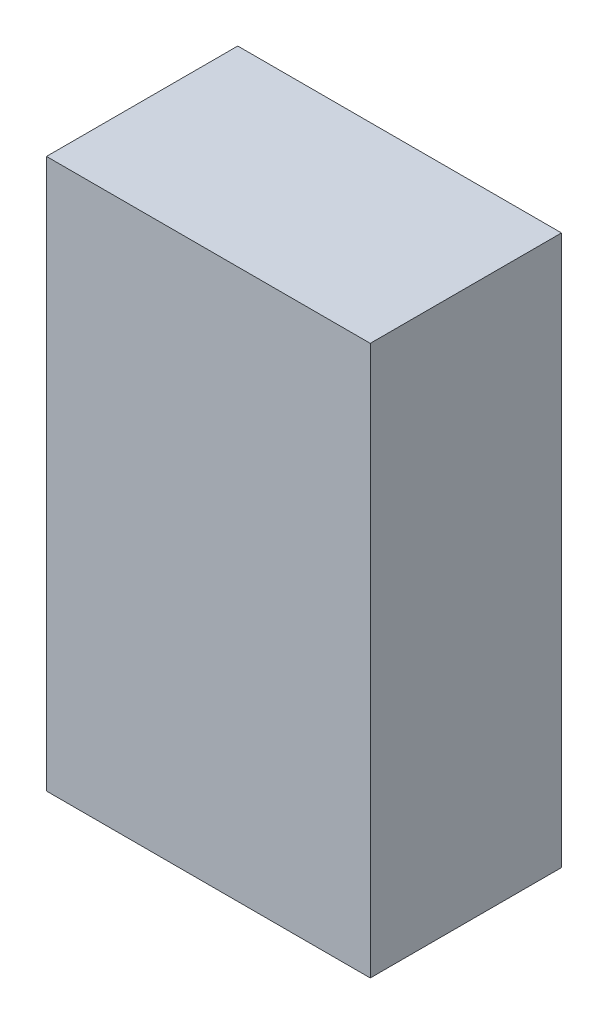
ISO-10303-21;
HEADER;
FILE_DESCRIPTION(('STEP AP214'),'2;1');
FILE_NAME('part.step','',(''),(''),'','','');
FILE_SCHEMA(('AUTOMOTIVE_DESIGN { 1 0 10303 214 1 1 1 1 }'));
ENDSEC;
DATA;
#1=APPLICATION_CONTEXT('core data for automotive mechanical design processes');
#2=APPLICATION_PROTOCOL_DEFINITION('international standard','automotive_design',2000,#1);
#3=PRODUCT_CONTEXT('',#1,'mechanical');
#4=PRODUCT('Part','Part','',(#3));
#5=PRODUCT_RELATED_PRODUCT_CATEGORY('part','',(#4));
#6=PRODUCT_DEFINITION_FORMATION('','',#4);
#7=PRODUCT_DEFINITION_CONTEXT('part definition',#1,'design');
#8=PRODUCT_DEFINITION('design','',#6,#7);
#9=PRODUCT_DEFINITION_SHAPE('','',#8);
#10=(LENGTH_UNIT() NAMED_UNIT(*) SI_UNIT(.MILLI.,.METRE.));
#11=(NAMED_UNIT(*) PLANE_ANGLE_UNIT() SI_UNIT($,.RADIAN.));
#12=(NAMED_UNIT(*) SI_UNIT($,.STERADIAN.) SOLID_ANGLE_UNIT());
#13=UNCERTAINTY_MEASURE_WITH_UNIT(LENGTH_MEASURE(1.E-05),#10,'distance_accuracy_value','');
#14=(GEOMETRIC_REPRESENTATION_CONTEXT(3) GLOBAL_UNCERTAINTY_ASSIGNED_CONTEXT((#13)) GLOBAL_UNIT_ASSIGNED_CONTEXT((#10,
#11,#12)) REPRESENTATION_CONTEXT('',''));
#15=CARTESIAN_POINT('',(0.,0.,0.));
#16=DIRECTION('',(0.,0.,1.));
#17=DIRECTION('',(1.,0.,0.));
#18=AXIS2_PLACEMENT_3D('',#15,#16,#17);
#19=CARTESIAN_POINT('',(0.21500084,0.36500054,0.));
#20=DIRECTION('',(0.,-1.,0.));
#21=DIRECTION('',(-1.,0.,0.));
#22=AXIS2_PLACEMENT_3D('',#19,#20,#21);
#23=PLANE('',#22);
#24=DIRECTION('',(-1.,0.,0.));
#25=VECTOR('',#24,1.);
#26=CARTESIAN_POINT('',(0.21500084,0.36500054,0.));
#27=LINE('',#26,#25);
#28=CARTESIAN_POINT('',(0.21500084,0.36500054,0.));
#29=VERTEX_POINT('',#28);
#30=CARTESIAN_POINT('',(-0.21500084,0.36500054,0.));
#31=VERTEX_POINT('',#30);
#32=EDGE_CURVE('E11',#29,#31,#27,.T.);
#33=ORIENTED_EDGE('',*,*,#32,.T.);
#34=DIRECTION('',(0.,0.,1.));
#35=VECTOR('',#34,1.);
#36=CARTESIAN_POINT('',(-0.21500084,0.36500054,0.));
#37=LINE('',#36,#35);
#38=CARTESIAN_POINT('',(-0.21500084,0.36500054,0.254));
#39=VERTEX_POINT('',#38);
#40=EDGE_CURVE('E24',#31,#39,#37,.T.);
#41=ORIENTED_EDGE('',*,*,#40,.T.);
#42=DIRECTION('',(-1.,0.,0.));
#43=VECTOR('',#42,1.);
#44=CARTESIAN_POINT('',(0.21500084,0.36500054,0.254));
#45=LINE('',#44,#43);
#46=CARTESIAN_POINT('',(0.21500084,0.36500054,0.254));
#47=VERTEX_POINT('',#46);
#48=EDGE_CURVE('E87',#47,#39,#45,.T.);
#49=ORIENTED_EDGE('',*,*,#48,.F.);
#50=DIRECTION('',(0.,0.,1.));
#51=VECTOR('',#50,1.);
#52=CARTESIAN_POINT('',(0.21500084,0.36500054,0.));
#53=LINE('',#52,#51);
#54=EDGE_CURVE('E36',#29,#47,#53,.T.);
#55=ORIENTED_EDGE('',*,*,#54,.F.);
#56=EDGE_LOOP('',(#33,#41,#49,#55));
#57=FACE_BOUND('',#56,.T.);
#58=ADVANCED_FACE('F17',(#57),#23,.F.);
#59=CARTESIAN_POINT('',(-0.21500084,0.36500054,0.));
#60=DIRECTION('',(1.,0.,0.));
#61=DIRECTION('',(0.,-1.,0.));
#62=AXIS2_PLACEMENT_3D('',#59,#60,#61);
#63=PLANE('',#62);
#64=DIRECTION('',(0.,-1.,0.));
#65=VECTOR('',#64,1.);
#66=CARTESIAN_POINT('',(-0.21500084,0.36500054,0.));
#67=LINE('',#66,#65);
#68=CARTESIAN_POINT('',(-0.21500084,-0.364998,0.));
#69=VERTEX_POINT('',#68);
#70=EDGE_CURVE('E84',#31,#69,#67,.T.);
#71=ORIENTED_EDGE('',*,*,#70,.T.);
#72=DIRECTION('',(0.,0.,1.));
#73=VECTOR('',#72,1.);
#74=CARTESIAN_POINT('',(-0.21500084,-0.364998,0.));
#75=LINE('',#74,#73);
#76=CARTESIAN_POINT('',(-0.21500084,-0.364998,0.254));
#77=VERTEX_POINT('',#76);
#78=EDGE_CURVE('E82',#69,#77,#75,.T.);
#79=ORIENTED_EDGE('',*,*,#78,.T.);
#80=DIRECTION('',(0.,-1.,0.));
#81=VECTOR('',#80,1.);
#82=CARTESIAN_POINT('',(-0.21500084,0.36500054,0.254));
#83=LINE('',#82,#81);
#84=EDGE_CURVE('E62',#39,#77,#83,.T.);
#85=ORIENTED_EDGE('',*,*,#84,.F.);
#86=ORIENTED_EDGE('',*,*,#40,.F.);
#87=EDGE_LOOP('',(#71,#79,#85,#86));
#88=FACE_BOUND('',#87,.T.);
#89=ADVANCED_FACE('F89',(#88),#63,.F.);
#90=CARTESIAN_POINT('',(-0.21500084,-0.364998,0.));
#91=DIRECTION('',(0.,1.,0.));
#92=DIRECTION('',(1.,0.,0.));
#93=AXIS2_PLACEMENT_3D('',#90,#91,#92);
#94=PLANE('',#93);
#95=DIRECTION('',(1.,0.,0.));
#96=VECTOR('',#95,1.);
#97=CARTESIAN_POINT('',(-0.21500084,-0.364998,0.));
#98=LINE('',#97,#96);
#99=CARTESIAN_POINT('',(0.21500084,-0.364998,0.));
#100=VERTEX_POINT('',#99);
#101=EDGE_CURVE('E71',#69,#100,#98,.T.);
#102=ORIENTED_EDGE('',*,*,#101,.T.);
#103=DIRECTION('',(0.,0.,1.));
#104=VECTOR('',#103,1.);
#105=CARTESIAN_POINT('',(0.21500084,-0.364998,0.));
#106=LINE('',#105,#104);
#107=CARTESIAN_POINT('',(0.21500084,-0.364998,0.254));
#108=VERTEX_POINT('',#107);
#109=EDGE_CURVE('E65',#100,#108,#106,.T.);
#110=ORIENTED_EDGE('',*,*,#109,.T.);
#111=DIRECTION('',(1.,0.,0.));
#112=VECTOR('',#111,1.);
#113=CARTESIAN_POINT('',(-0.21500084,-0.364998,0.254));
#114=LINE('',#113,#112);
#115=EDGE_CURVE('E57',#77,#108,#114,.T.);
#116=ORIENTED_EDGE('',*,*,#115,.F.);
#117=ORIENTED_EDGE('',*,*,#78,.F.);
#118=EDGE_LOOP('',(#102,#110,#116,#117));
#119=FACE_BOUND('',#118,.T.);
#120=ADVANCED_FACE('F69',(#119),#94,.F.);
#121=CARTESIAN_POINT('',(0.21500084,-0.364998,0.));
#122=DIRECTION('',(-1.,0.,0.));
#123=DIRECTION('',(0.,1.,0.));
#124=AXIS2_PLACEMENT_3D('',#121,#122,#123);
#125=PLANE('',#124);
#126=DIRECTION('',(0.,1.,0.));
#127=VECTOR('',#126,1.);
#128=CARTESIAN_POINT('',(0.21500084,-0.364998,0.));
#129=LINE('',#128,#127);
#130=EDGE_CURVE('E66',#100,#29,#129,.T.);
#131=ORIENTED_EDGE('',*,*,#130,.T.);
#132=ORIENTED_EDGE('',*,*,#54,.T.);
#133=DIRECTION('',(0.,1.,0.));
#134=VECTOR('',#133,1.);
#135=CARTESIAN_POINT('',(0.21500084,-0.364998,0.254));
#136=LINE('',#135,#134);
#137=EDGE_CURVE('E61',#108,#47,#136,.T.);
#138=ORIENTED_EDGE('',*,*,#137,.F.);
#139=ORIENTED_EDGE('',*,*,#109,.F.);
#140=EDGE_LOOP('',(#131,#132,#138,#139));
#141=FACE_BOUND('',#140,.T.);
#142=ADVANCED_FACE('F76',(#141),#125,.F.);
#143=CARTESIAN_POINT('',(0.21500084,0.36500054,0.));
#144=DIRECTION('',(0.,0.,-1.));
#145=DIRECTION('',(-1.,0.,0.));
#146=AXIS2_PLACEMENT_3D('',#143,#144,#145);
#147=PLANE('',#146);
#148=ORIENTED_EDGE('',*,*,#130,.F.);
#149=ORIENTED_EDGE('',*,*,#101,.F.);
#150=ORIENTED_EDGE('',*,*,#70,.F.);
#151=ORIENTED_EDGE('',*,*,#32,.F.);
#152=EDGE_LOOP('',(#148,#149,#150,#151));
#153=FACE_BOUND('',#152,.T.);
#154=ADVANCED_FACE('F91',(#153),#147,.T.);
#155=CARTESIAN_POINT('',(0.21500084,0.36500054,0.254));
#156=DIRECTION('',(0.,0.,-1.));
#157=DIRECTION('',(-1.,0.,0.));
#158=AXIS2_PLACEMENT_3D('',#155,#156,#157);
#159=PLANE('',#158);
#160=ORIENTED_EDGE('',*,*,#48,.T.);
#161=ORIENTED_EDGE('',*,*,#84,.T.);
#162=ORIENTED_EDGE('',*,*,#115,.T.);
#163=ORIENTED_EDGE('',*,*,#137,.T.);
#164=EDGE_LOOP('',(#160,#161,#162,#163));
#165=FACE_BOUND('',#164,.T.);
#166=ADVANCED_FACE('F59',(#165),#159,.F.);
#167=CLOSED_SHELL('',(#58,#89,#120,#142,#154,#166));
#168=MANIFOLD_SOLID_BREP('B1',#167);
#169=ADVANCED_BREP_SHAPE_REPRESENTATION('',(#18,#168),#14);
#170=SHAPE_DEFINITION_REPRESENTATION(#9,#169);
ENDSEC;
END-ISO-10303-21;
